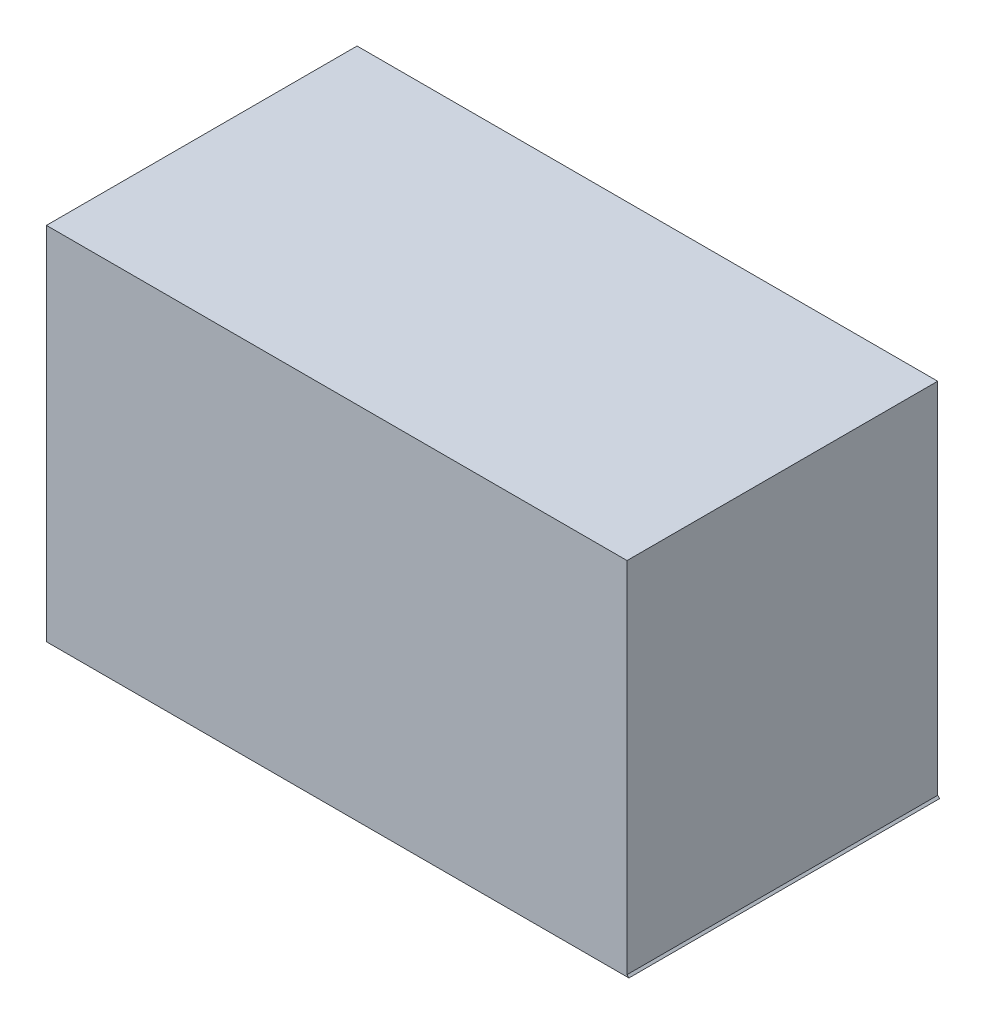
ISO-10303-21;
HEADER;
FILE_DESCRIPTION(('STEP AP214'),'2;1');
FILE_NAME('part.step','',(''),(''),'','','');
FILE_SCHEMA(('AUTOMOTIVE_DESIGN { 1 0 10303 214 1 1 1 1 }'));
ENDSEC;
DATA;
#1=APPLICATION_CONTEXT('core data for automotive mechanical design processes');
#2=APPLICATION_PROTOCOL_DEFINITION('international standard','automotive_design',2000,#1);
#3=PRODUCT_CONTEXT('',#1,'mechanical');
#4=PRODUCT('Part','Part','',(#3));
#5=PRODUCT_RELATED_PRODUCT_CATEGORY('part','',(#4));
#6=PRODUCT_DEFINITION_FORMATION('','',#4);
#7=PRODUCT_DEFINITION_CONTEXT('part definition',#1,'design');
#8=PRODUCT_DEFINITION('design','',#6,#7);
#9=PRODUCT_DEFINITION_SHAPE('','',#8);
#10=(LENGTH_UNIT() NAMED_UNIT(*) SI_UNIT(.MILLI.,.METRE.));
#11=(NAMED_UNIT(*) PLANE_ANGLE_UNIT() SI_UNIT($,.RADIAN.));
#12=(NAMED_UNIT(*) SI_UNIT($,.STERADIAN.) SOLID_ANGLE_UNIT());
#13=UNCERTAINTY_MEASURE_WITH_UNIT(LENGTH_MEASURE(1.E-05),#10,'distance_accuracy_value','');
#14=(GEOMETRIC_REPRESENTATION_CONTEXT(3) GLOBAL_UNCERTAINTY_ASSIGNED_CONTEXT((#13)) GLOBAL_UNIT_ASSIGNED_CONTEXT((#10,
#11,#12)) REPRESENTATION_CONTEXT('',''));
#15=CARTESIAN_POINT('',(0.,0.,0.));
#16=DIRECTION('',(0.,0.,1.));
#17=DIRECTION('',(1.,0.,0.));
#18=AXIS2_PLACEMENT_3D('',#15,#16,#17);
#19=CARTESIAN_POINT('',(0.993394,0.61950854,0.));
#20=DIRECTION('',(0.,0.,-1.));
#21=DIRECTION('',(-1.,0.,0.));
#22=AXIS2_PLACEMENT_3D('',#19,#20,#21);
#23=PLANE('',#22);
#24=DIRECTION('',(-4.10340582194828E-06,0.999999999991581,0.));
#25=VECTOR('',#24,1.);
#26=CARTESIAN_POINT('',(-1.000506,0.618998,0.));
#27=LINE('',#26,#25);
#28=CARTESIAN_POINT('',(-1.00024692,-0.619252,0.));
#29=VERTEX_POINT('',#28);
#30=CARTESIAN_POINT('',(-1.000252,0.619252000000016,0.));
#31=VERTEX_POINT('',#30);
#32=EDGE_CURVE('E93',#29,#31,#27,.T.);
#33=ORIENTED_EDGE('',*,*,#32,.T.);
#34=DIRECTION('',(0.999999999999188,1.27420997404124E-06,0.));
#35=VECTOR('',#34,1.);
#36=CARTESIAN_POINT('',(0.993394,0.61950854,0.));
#37=LINE('',#36,#35);
#38=CARTESIAN_POINT('',(0.993648000000016,0.61925454,0.));
#39=VERTEX_POINT('',#38);
#40=EDGE_CURVE('E65',#31,#39,#37,.T.);
#41=ORIENTED_EDGE('',*,*,#40,.T.);
#42=DIRECTION('',(2.06305519420774E-06,-0.999999999997872,0.));
#43=VECTOR('',#42,1.);
#44=CARTESIAN_POINT('',(0.99390454,-0.61218318,0.));
#45=LINE('',#44,#43);
#46=CARTESIAN_POINT('',(0.99390454,-0.61218318,0.));
#47=VERTEX_POINT('',#46);
#48=EDGE_CURVE('E61',#39,#47,#45,.T.);
#49=ORIENTED_EDGE('',*,*,#48,.T.);
#50=DIRECTION('',(0.707106781186548,-0.707106781186548,0.));
#51=VECTOR('',#50,1.);
#52=CARTESIAN_POINT('',(1.00033074,-0.61860938,0.));
#53=LINE('',#52,#51);
#54=CARTESIAN_POINT('',(1.00016564,-0.619056419999987,0.));
#55=VERTEX_POINT('',#54);
#56=EDGE_CURVE('E63',#47,#55,#53,.T.);
#57=ORIENTED_EDGE('',*,*,#56,.T.);
#58=DIRECTION('',(-0.999999999999194,-1.27000416562225E-06,0.));
#59=VECTOR('',#58,1.);
#60=CARTESIAN_POINT('',(-0.99999292,-0.619506,0.));
#61=LINE('',#60,#59);
#62=EDGE_CURVE('E101',#55,#29,#61,.T.);
#63=ORIENTED_EDGE('',*,*,#62,.T.);
#64=EDGE_LOOP('',(#33,#41,#49,#57,#63));
#65=FACE_BOUND('',#64,.T.);
#66=ADVANCED_FACE('F17',(#65),#23,.T.);
#67=CARTESIAN_POINT('',(0.99390454,-0.61218318,0.));
#68=DIRECTION('',(-0.999999999997872,-2.06305519420774E-06,0.));
#69=DIRECTION('',(2.06305519420774E-06,-0.999999999997872,0.));
#70=AXIS2_PLACEMENT_3D('',#67,#68,#69);
#71=PLANE('',#70);
#72=DIRECTION('',(0.,0.,1.));
#73=VECTOR('',#72,1.);
#74=CARTESIAN_POINT('',(0.993901998951998,0.619508540647297,0.));
#75=LINE('',#74,#73);
#76=CARTESIAN_POINT('',(0.993648000000008,0.61925454,1.0668));
#77=VERTEX_POINT('',#76);
#78=EDGE_CURVE('E95',#39,#77,#75,.T.);
#79=ORIENTED_EDGE('',*,*,#78,.T.);
#80=DIRECTION('',(0.,1.,0.));
#81=VECTOR('',#80,1.);
#82=CARTESIAN_POINT('',(0.993902,0.61950854,1.0668));
#83=LINE('',#82,#81);
#84=CARTESIAN_POINT('',(0.993902846666667,-0.612181486666667,1.0668));
#85=VERTEX_POINT('',#84);
#86=EDGE_CURVE('E82',#77,#85,#83,.F.);
#87=ORIENTED_EDGE('',*,*,#86,.T.);
#88=DIRECTION('',(0.,0.,1.));
#89=VECTOR('',#88,1.);
#90=CARTESIAN_POINT('',(0.99390454,-0.61218318,0.));
#91=LINE('',#90,#89);
#92=EDGE_CURVE('E70',#85,#47,#91,.F.);
#93=ORIENTED_EDGE('',*,*,#92,.T.);
#94=ORIENTED_EDGE('',*,*,#48,.F.);
#95=EDGE_LOOP('',(#79,#87,#93,#94));
#96=FACE_BOUND('',#95,.T.);
#97=ADVANCED_FACE('F81',(#96),#71,.F.);
#98=CARTESIAN_POINT('',(1.00033074,-0.61860938,0.));
#99=DIRECTION('',(-0.707106781186548,-0.707106781186548,0.));
#100=DIRECTION('',(0.707106781186548,-0.707106781186548,0.));
#101=AXIS2_PLACEMENT_3D('',#98,#99,#100);
#102=PLANE('',#101);
#103=ORIENTED_EDGE('',*,*,#92,.F.);
#104=DIRECTION('',(0.707106781186559,-0.707106781186536,0.));
#105=VECTOR('',#104,1.);
#106=CARTESIAN_POINT('',(0.99390454,-0.61218318,1.0668));
#107=LINE('',#106,#105);
#108=CARTESIAN_POINT('',(1.00016564,-0.619056419999994,1.0668));
#109=VERTEX_POINT('',#108);
#110=EDGE_CURVE('E151',#85,#109,#107,.T.);
#111=ORIENTED_EDGE('',*,*,#110,.T.);
#112=CARTESIAN_POINT('',(1.00033074,-0.61860938,1.0668));
#113=DIRECTION('',(0.,0.,-1.));
#114=VECTOR('',#113,1.);
#115=LINE('',#112,#114);
#116=EDGE_CURVE('E77',#109,#55,#115,.T.);
#117=ORIENTED_EDGE('',*,*,#116,.T.);
#118=ORIENTED_EDGE('',*,*,#56,.F.);
#119=EDGE_LOOP('',(#103,#111,#117,#118));
#120=FACE_BOUND('',#119,.T.);
#121=ADVANCED_FACE('F74',(#120),#102,.F.);
#122=CARTESIAN_POINT('',(-0.99999292,-0.619506,0.));
#123=DIRECTION('',(-1.27000416562225E-06,0.999999999999194,0.));
#124=DIRECTION('',(-0.999999999999194,-1.27000416562225E-06,0.));
#125=AXIS2_PLACEMENT_3D('',#122,#123,#124);
#126=PLANE('',#125);
#127=ORIENTED_EDGE('',*,*,#116,.F.);
#128=DIRECTION('',(-1.,0.,0.));
#129=VECTOR('',#128,1.);
#130=CARTESIAN_POINT('',(0.993394,-0.61950346,1.0668));
#131=LINE('',#130,#129);
#132=CARTESIAN_POINT('',(-1.00024692,-0.619252,1.0668));
#133=VERTEX_POINT('',#132);
#134=EDGE_CURVE('E143',#109,#133,#131,.T.);
#135=ORIENTED_EDGE('',*,*,#134,.T.);
#136=DIRECTION('',(0.,0.,-1.));
#137=VECTOR('',#136,1.);
#138=CARTESIAN_POINT('',(-1.00050091791547,-0.619506000645159,0.));
#139=LINE('',#138,#137);
#140=EDGE_CURVE('E96',#133,#29,#139,.T.);
#141=ORIENTED_EDGE('',*,*,#140,.T.);
#142=ORIENTED_EDGE('',*,*,#62,.F.);
#143=EDGE_LOOP('',(#127,#135,#141,#142));
#144=FACE_BOUND('',#143,.T.);
#145=ADVANCED_FACE('F113',(#144),#126,.F.);
#146=CARTESIAN_POINT('',(-1.000506,0.618998,0.));
#147=DIRECTION('',(0.999999999991581,4.10340582194828E-06,0.));
#148=DIRECTION('',(-4.10340582194828E-06,0.999999999991581,0.));
#149=AXIS2_PLACEMENT_3D('',#146,#147,#148);
#150=PLANE('',#149);
#151=ORIENTED_EDGE('',*,*,#140,.F.);
#152=DIRECTION('',(0.,1.,0.));
#153=VECTOR('',#152,1.);
#154=CARTESIAN_POINT('',(-1.00050092,0.61950854,1.0668));
#155=LINE('',#154,#153);
#156=CARTESIAN_POINT('',(-1.000252,0.619252000000008,1.0668));
#157=VERTEX_POINT('',#156);
#158=EDGE_CURVE('E26',#133,#157,#155,.T.);
#159=ORIENTED_EDGE('',*,*,#158,.T.);
#160=DIRECTION('',(0.,0.,-1.));
#161=VECTOR('',#160,1.);
#162=CARTESIAN_POINT('',(-1.00050600208453,0.61950599935273,0.));
#163=LINE('',#162,#161);
#164=EDGE_CURVE('E34',#157,#31,#163,.T.);
#165=ORIENTED_EDGE('',*,*,#164,.T.);
#166=ORIENTED_EDGE('',*,*,#32,.F.);
#167=EDGE_LOOP('',(#151,#159,#165,#166));
#168=FACE_BOUND('',#167,.T.);
#169=ADVANCED_FACE('F123',(#168),#150,.F.);
#170=CARTESIAN_POINT('',(0.993394,0.61950854,0.));
#171=DIRECTION('',(1.27420997404124E-06,-0.999999999999188,0.));
#172=DIRECTION('',(0.999999999999188,1.27420997404124E-06,0.));
#173=AXIS2_PLACEMENT_3D('',#170,#171,#172);
#174=PLANE('',#173);
#175=ORIENTED_EDGE('',*,*,#164,.F.);
#176=DIRECTION('',(-1.,0.,0.));
#177=VECTOR('',#176,1.);
#178=CARTESIAN_POINT('',(0.993394,0.619506,1.0668));
#179=LINE('',#178,#177);
#180=EDGE_CURVE('E11',#157,#77,#179,.F.);
#181=ORIENTED_EDGE('',*,*,#180,.T.);
#182=ORIENTED_EDGE('',*,*,#78,.F.);
#183=ORIENTED_EDGE('',*,*,#40,.F.);
#184=EDGE_LOOP('',(#175,#181,#182,#183));
#185=FACE_BOUND('',#184,.T.);
#186=ADVANCED_FACE('F162',(#185),#174,.F.);
#187=CARTESIAN_POINT('',(0.993394,0.61950854,1.0668));
#188=DIRECTION('',(0.,0.,-1.));
#189=DIRECTION('',(-1.,0.,0.));
#190=AXIS2_PLACEMENT_3D('',#187,#188,#189);
#191=PLANE('',#190);
#192=ORIENTED_EDGE('',*,*,#158,.F.);
#193=ORIENTED_EDGE('',*,*,#134,.F.);
#194=ORIENTED_EDGE('',*,*,#110,.F.);
#195=ORIENTED_EDGE('',*,*,#86,.F.);
#196=ORIENTED_EDGE('',*,*,#180,.F.);
#197=EDGE_LOOP('',(#192,#193,#194,#195,#196));
#198=FACE_BOUND('',#197,.T.);
#199=ADVANCED_FACE('F149',(#198),#191,.F.);
#200=CLOSED_SHELL('',(#66,#97,#121,#145,#169,#186,#199));
#201=MANIFOLD_SOLID_BREP('B1',#200);
#202=ADVANCED_BREP_SHAPE_REPRESENTATION('',(#18,#201),#14);
#203=SHAPE_DEFINITION_REPRESENTATION(#9,#202);
ENDSEC;
END-ISO-10303-21;
